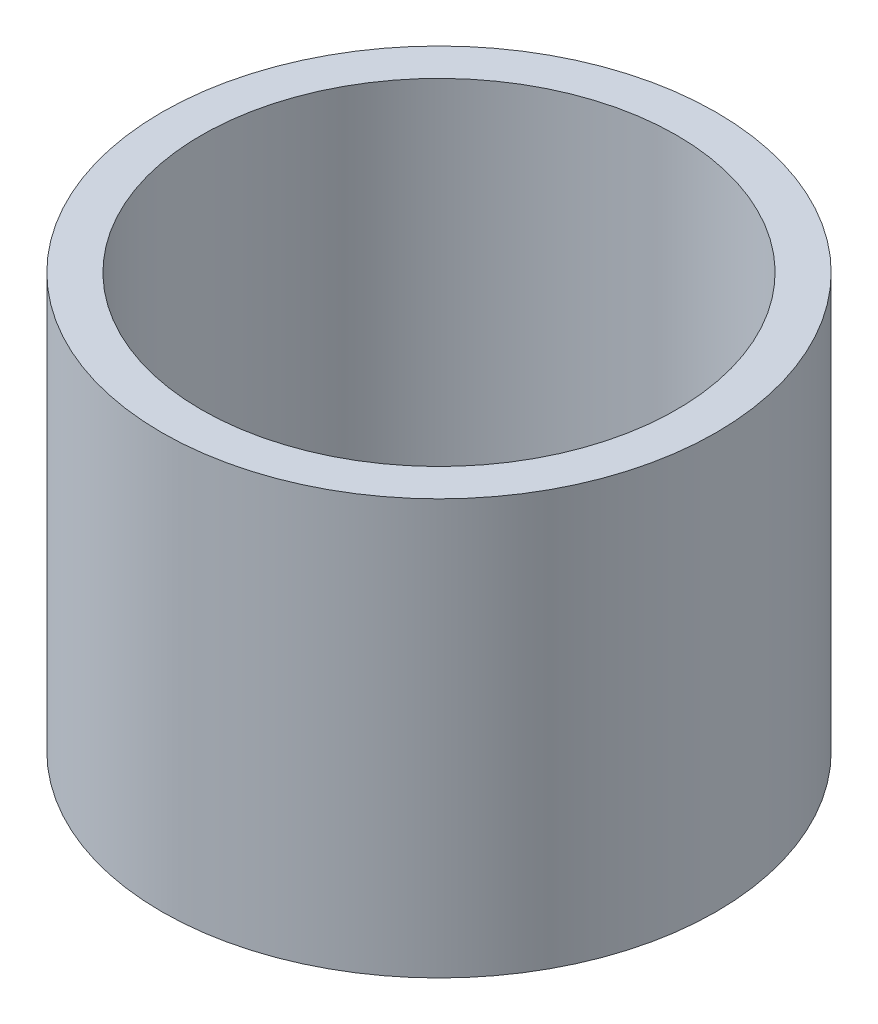
ISO-10303-21;
HEADER;
FILE_DESCRIPTION(('STEP AP214'),'2;1');
FILE_NAME('part.step','',(''),(''),'','','');
FILE_SCHEMA(('AUTOMOTIVE_DESIGN { 1 0 10303 214 1 1 1 1 }'));
ENDSEC;
DATA;
#1=APPLICATION_CONTEXT('core data for automotive mechanical design processes');
#2=APPLICATION_PROTOCOL_DEFINITION('international standard','automotive_design',2000,#1);
#3=PRODUCT_CONTEXT('',#1,'mechanical');
#4=PRODUCT('Part','Part','',(#3));
#5=PRODUCT_RELATED_PRODUCT_CATEGORY('part','',(#4));
#6=PRODUCT_DEFINITION_FORMATION('','',#4);
#7=PRODUCT_DEFINITION_CONTEXT('part definition',#1,'design');
#8=PRODUCT_DEFINITION('design','',#6,#7);
#9=PRODUCT_DEFINITION_SHAPE('','',#8);
#10=(LENGTH_UNIT() NAMED_UNIT(*) SI_UNIT(.MILLI.,.METRE.));
#11=(NAMED_UNIT(*) PLANE_ANGLE_UNIT() SI_UNIT($,.RADIAN.));
#12=(NAMED_UNIT(*) SI_UNIT($,.STERADIAN.) SOLID_ANGLE_UNIT());
#13=UNCERTAINTY_MEASURE_WITH_UNIT(LENGTH_MEASURE(1.E-05),#10,'distance_accuracy_value','');
#14=(GEOMETRIC_REPRESENTATION_CONTEXT(3) GLOBAL_UNCERTAINTY_ASSIGNED_CONTEXT((#13)) GLOBAL_UNIT_ASSIGNED_CONTEXT((#10,
#11,#12)) REPRESENTATION_CONTEXT('',''));
#15=CARTESIAN_POINT('',(0.,0.,0.));
#16=DIRECTION('',(0.,0.,1.));
#17=DIRECTION('',(1.,0.,0.));
#18=AXIS2_PLACEMENT_3D('',#15,#16,#17);
#19=CARTESIAN_POINT('',(0.,45.,0.));
#20=DIRECTION('',(0.,1.,0.));
#21=DIRECTION('',(0.,0.,1.));
#22=AXIS2_PLACEMENT_3D('',#19,#20,#21);
#23=PLANE('',#22);
#24=CARTESIAN_POINT('',(0.,45.,0.));
#25=DIRECTION('',(0.,1.,0.));
#26=DIRECTION('',(0.,0.,1.));
#27=AXIS2_PLACEMENT_3D('',#24,#25,#26);
#28=CIRCLE('',#27,30.075);
#29=CARTESIAN_POINT('',(0.,45.,30.075));
#30=VERTEX_POINT('',#29);
#31=EDGE_CURVE('E10',#30,#30,#28,.T.);
#32=ORIENTED_EDGE('',*,*,#31,.T.);
#33=EDGE_LOOP('',(#32));
#34=FACE_BOUND('',#33,.T.);
#35=CARTESIAN_POINT('',(0.,45.,0.));
#36=DIRECTION('',(0.,1.,0.));
#37=DIRECTION('',(0.,0.,1.));
#38=AXIS2_PLACEMENT_3D('',#35,#36,#37);
#39=CIRCLE('',#38,25.775);
#40=CARTESIAN_POINT('',(0.,45.,25.775));
#41=VERTEX_POINT('',#40);
#42=EDGE_CURVE('E42',#41,#41,#39,.T.);
#43=ORIENTED_EDGE('',*,*,#42,.F.);
#44=EDGE_LOOP('',(#43));
#45=FACE_BOUND('',#44,.T.);
#46=ADVANCED_FACE('F31',(#34,#45),#23,.T.);
#47=CARTESIAN_POINT('',(0.,0.,0.));
#48=DIRECTION('',(0.,1.,0.));
#49=DIRECTION('',(0.,0.,1.));
#50=AXIS2_PLACEMENT_3D('',#47,#48,#49);
#51=PLANE('',#50);
#52=CARTESIAN_POINT('',(0.,0.,0.));
#53=DIRECTION('',(0.,1.,0.));
#54=DIRECTION('',(0.,0.,1.));
#55=AXIS2_PLACEMENT_3D('',#52,#53,#54);
#56=CIRCLE('',#55,30.075);
#57=CARTESIAN_POINT('',(0.,0.,30.075));
#58=VERTEX_POINT('',#57);
#59=EDGE_CURVE('E35',#58,#58,#56,.T.);
#60=ORIENTED_EDGE('',*,*,#59,.F.);
#61=EDGE_LOOP('',(#60));
#62=FACE_BOUND('',#61,.T.);
#63=CARTESIAN_POINT('',(0.,0.,0.));
#64=DIRECTION('',(0.,1.,0.));
#65=DIRECTION('',(0.,0.,1.));
#66=AXIS2_PLACEMENT_3D('',#63,#64,#65);
#67=CIRCLE('',#66,25.775);
#68=CARTESIAN_POINT('',(0.,0.,25.775));
#69=VERTEX_POINT('',#68);
#70=EDGE_CURVE('E44',#69,#69,#67,.T.);
#71=ORIENTED_EDGE('',*,*,#70,.T.);
#72=EDGE_LOOP('',(#71));
#73=FACE_BOUND('',#72,.T.);
#74=ADVANCED_FACE('F54',(#62,#73),#51,.F.);
#75=CARTESIAN_POINT('',(0.,45.,0.));
#76=DIRECTION('',(0.,-1.,0.));
#77=DIRECTION('',(0.,0.,-1.));
#78=AXIS2_PLACEMENT_3D('',#75,#76,#77);
#79=CYLINDRICAL_SURFACE('',#78,30.075);
#80=ORIENTED_EDGE('',*,*,#31,.F.);
#81=EDGE_LOOP('',(#80));
#82=FACE_BOUND('',#81,.T.);
#83=ORIENTED_EDGE('',*,*,#59,.T.);
#84=EDGE_LOOP('',(#83));
#85=FACE_BOUND('',#84,.T.);
#86=ADVANCED_FACE('F33',(#82,#85),#79,.T.);
#87=CARTESIAN_POINT('',(0.,45.,0.));
#88=DIRECTION('',(0.,-1.,0.));
#89=DIRECTION('',(0.,0.,-1.));
#90=AXIS2_PLACEMENT_3D('',#87,#88,#89);
#91=CYLINDRICAL_SURFACE('',#90,25.775);
#92=ORIENTED_EDGE('',*,*,#42,.T.);
#93=EDGE_LOOP('',(#92));
#94=FACE_BOUND('',#93,.T.);
#95=ORIENTED_EDGE('',*,*,#70,.F.);
#96=EDGE_LOOP('',(#95));
#97=FACE_BOUND('',#96,.T.);
#98=ADVANCED_FACE('F50',(#94,#97),#91,.F.);
#99=CLOSED_SHELL('',(#46,#74,#86,#98));
#100=MANIFOLD_SOLID_BREP('B2',#99);
#101=ADVANCED_BREP_SHAPE_REPRESENTATION('',(#18,#100),#14);
#102=SHAPE_DEFINITION_REPRESENTATION(#9,#101);
ENDSEC;
END-ISO-10303-21;
